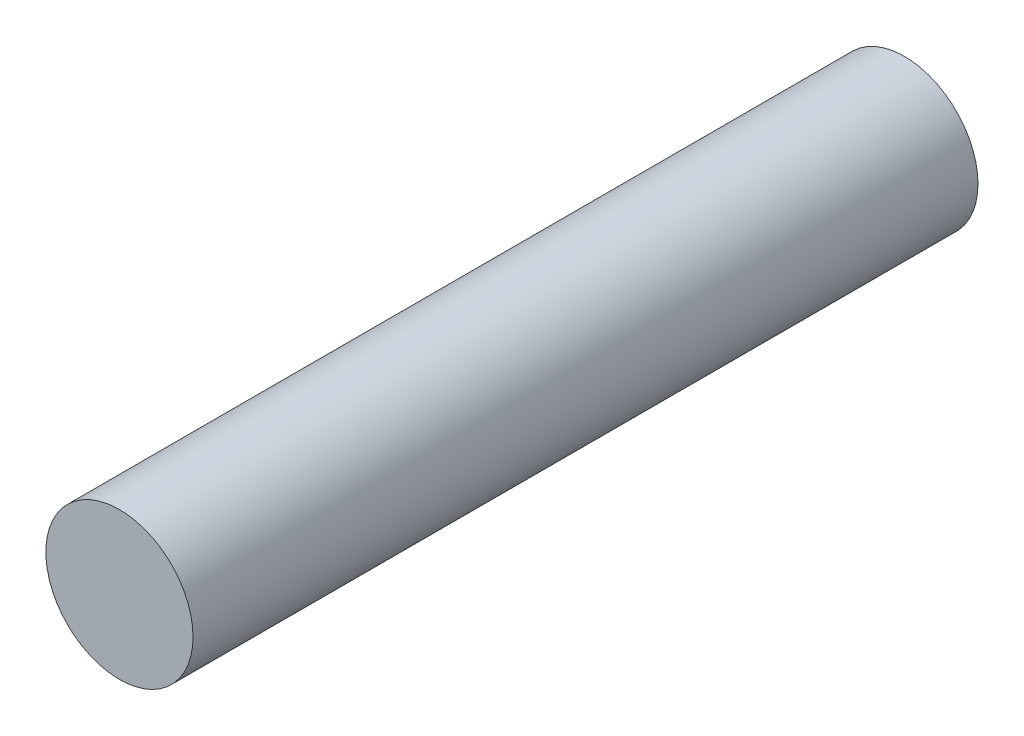
ISO-10303-21;
HEADER;
FILE_DESCRIPTION(('STEP AP214'),'2;1');
FILE_NAME('part.step','',(''),(''),'','','');
FILE_SCHEMA(('AUTOMOTIVE_DESIGN { 1 0 10303 214 1 1 1 1 }'));
ENDSEC;
DATA;
#1=APPLICATION_CONTEXT('core data for automotive mechanical design processes');
#2=APPLICATION_PROTOCOL_DEFINITION('international standard','automotive_design',2000,#1);
#3=PRODUCT_CONTEXT('',#1,'mechanical');
#4=PRODUCT('Part','Part','',(#3));
#5=PRODUCT_RELATED_PRODUCT_CATEGORY('part','',(#4));
#6=PRODUCT_DEFINITION_FORMATION('','',#4);
#7=PRODUCT_DEFINITION_CONTEXT('part definition',#1,'design');
#8=PRODUCT_DEFINITION('design','',#6,#7);
#9=PRODUCT_DEFINITION_SHAPE('','',#8);
#10=(LENGTH_UNIT() NAMED_UNIT(*) SI_UNIT(.MILLI.,.METRE.));
#11=(NAMED_UNIT(*) PLANE_ANGLE_UNIT() SI_UNIT($,.RADIAN.));
#12=(NAMED_UNIT(*) SI_UNIT($,.STERADIAN.) SOLID_ANGLE_UNIT());
#13=UNCERTAINTY_MEASURE_WITH_UNIT(LENGTH_MEASURE(1.E-05),#10,'distance_accuracy_value','');
#14=(GEOMETRIC_REPRESENTATION_CONTEXT(3) GLOBAL_UNCERTAINTY_ASSIGNED_CONTEXT((#13)) GLOBAL_UNIT_ASSIGNED_CONTEXT((#10,
#11,#12)) REPRESENTATION_CONTEXT('',''));
#15=CARTESIAN_POINT('',(0.,0.,0.));
#16=DIRECTION('',(0.,0.,1.));
#17=DIRECTION('',(1.,0.,0.));
#18=AXIS2_PLACEMENT_3D('',#15,#16,#17);
#19=CARTESIAN_POINT('',(0.,0.,203.2));
#20=DIRECTION('',(0.,0.,-1.));
#21=DIRECTION('',(-1.,0.,0.));
#22=AXIS2_PLACEMENT_3D('',#19,#20,#21);
#23=CYLINDRICAL_SURFACE('',#22,19.05);
#24=CARTESIAN_POINT('',(0.,0.,203.2));
#25=DIRECTION('',(0.,0.,1.));
#26=DIRECTION('',(1.,0.,0.));
#27=AXIS2_PLACEMENT_3D('',#24,#25,#26);
#28=CIRCLE('',#27,19.05);
#29=CARTESIAN_POINT('',(19.05,0.,203.2));
#30=VERTEX_POINT('',#29);
#31=EDGE_CURVE('E10',#30,#30,#28,.T.);
#32=ORIENTED_EDGE('',*,*,#31,.F.);
#33=EDGE_LOOP('',(#32));
#34=FACE_BOUND('',#33,.T.);
#35=CARTESIAN_POINT('',(0.,0.,0.));
#36=DIRECTION('',(0.,0.,1.));
#37=DIRECTION('',(1.,0.,0.));
#38=AXIS2_PLACEMENT_3D('',#35,#36,#37);
#39=CIRCLE('',#38,19.05);
#40=CARTESIAN_POINT('',(19.05,0.,0.));
#41=VERTEX_POINT('',#40);
#42=EDGE_CURVE('E40',#41,#41,#39,.T.);
#43=ORIENTED_EDGE('',*,*,#42,.T.);
#44=EDGE_LOOP('',(#43));
#45=FACE_BOUND('',#44,.T.);
#46=ADVANCED_FACE('F37',(#34,#45),#23,.T.);
#47=CARTESIAN_POINT('',(0.,0.,203.2));
#48=DIRECTION('',(0.,0.,1.));
#49=DIRECTION('',(1.,0.,0.));
#50=AXIS2_PLACEMENT_3D('',#47,#48,#49);
#51=PLANE('',#50);
#52=ORIENTED_EDGE('',*,*,#31,.T.);
#53=EDGE_LOOP('',(#52));
#54=FACE_BOUND('',#53,.T.);
#55=ADVANCED_FACE('F54',(#54),#51,.T.);
#56=CARTESIAN_POINT('',(0.,0.,0.));
#57=DIRECTION('',(0.,0.,1.));
#58=DIRECTION('',(1.,0.,0.));
#59=AXIS2_PLACEMENT_3D('',#56,#57,#58);
#60=PLANE('',#59);
#61=ORIENTED_EDGE('',*,*,#42,.F.);
#62=EDGE_LOOP('',(#61));
#63=FACE_BOUND('',#62,.T.);
#64=ADVANCED_FACE('F52',(#63),#60,.F.);
#65=CLOSED_SHELL('',(#46,#55,#64));
#66=MANIFOLD_SOLID_BREP('B2',#65);
#67=ADVANCED_BREP_SHAPE_REPRESENTATION('',(#18,#66),#14);
#68=SHAPE_DEFINITION_REPRESENTATION(#9,#67);
ENDSEC;
END-ISO-10303-21;
